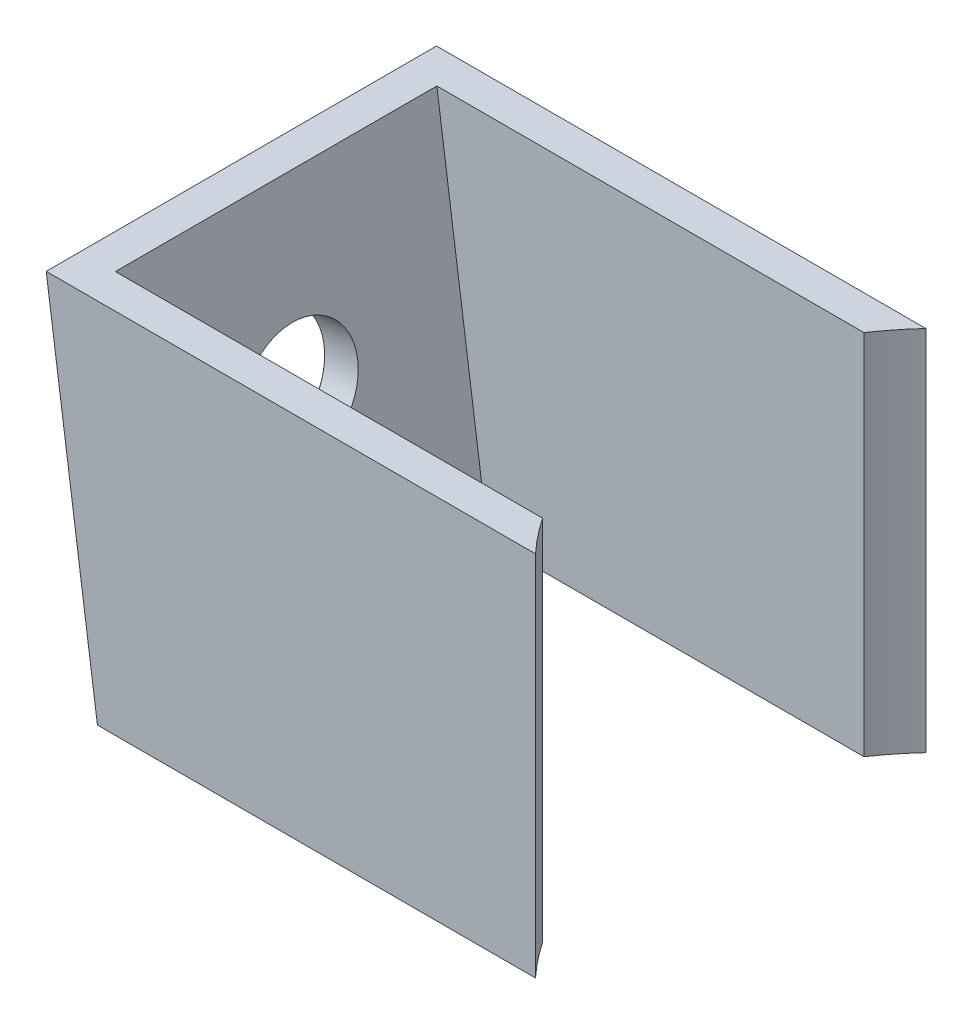
ISO-10303-21;
HEADER;
FILE_DESCRIPTION(('STEP AP214'),'2;1');
FILE_NAME('part.step','',(''),(''),'','','');
FILE_SCHEMA(('AUTOMOTIVE_DESIGN { 1 0 10303 214 1 1 1 1 }'));
ENDSEC;
DATA;
#1=APPLICATION_CONTEXT('core data for automotive mechanical design processes');
#2=APPLICATION_PROTOCOL_DEFINITION('international standard','automotive_design',2000,#1);
#3=PRODUCT_CONTEXT('',#1,'mechanical');
#4=PRODUCT('Part','Part','',(#3));
#5=PRODUCT_RELATED_PRODUCT_CATEGORY('part','',(#4));
#6=PRODUCT_DEFINITION_FORMATION('','',#4);
#7=PRODUCT_DEFINITION_CONTEXT('part definition',#1,'design');
#8=PRODUCT_DEFINITION('design','',#6,#7);
#9=PRODUCT_DEFINITION_SHAPE('','',#8);
#10=(LENGTH_UNIT() NAMED_UNIT(*) SI_UNIT(.MILLI.,.METRE.));
#11=(NAMED_UNIT(*) PLANE_ANGLE_UNIT() SI_UNIT($,.RADIAN.));
#12=(NAMED_UNIT(*) SI_UNIT($,.STERADIAN.) SOLID_ANGLE_UNIT());
#13=UNCERTAINTY_MEASURE_WITH_UNIT(LENGTH_MEASURE(1.E-05),#10,'distance_accuracy_value','');
#14=(GEOMETRIC_REPRESENTATION_CONTEXT(3) GLOBAL_UNCERTAINTY_ASSIGNED_CONTEXT((#13)) GLOBAL_UNIT_ASSIGNED_CONTEXT((#10,
#11,#12)) REPRESENTATION_CONTEXT('',''));
#15=CARTESIAN_POINT('',(0.,0.,0.));
#16=DIRECTION('',(0.,0.,1.));
#17=DIRECTION('',(1.,0.,0.));
#18=AXIS2_PLACEMENT_3D('',#15,#16,#17);
#19=CARTESIAN_POINT('',(-9.60468635614928,8.,17.));
#20=DIRECTION('',(0.,-1.,0.));
#21=DIRECTION('',(1.,0.,0.));
#22=AXIS2_PLACEMENT_3D('',#19,#20,#21);
#23=PLANE('',#22);
#24=DIRECTION('',(-1.,0.,0.));
#25=VECTOR('',#24,1.);
#26=CARTESIAN_POINT('',(-9.60468635614928,8.,17.));
#27=LINE('',#26,#25);
#28=CARTESIAN_POINT('',(-9.60468635614928,8.,17.));
#29=VERTEX_POINT('',#28);
#30=CARTESIAN_POINT('',(-30.9146863561493,7.99999999999999,17.));
#31=VERTEX_POINT('',#30);
#32=EDGE_CURVE('E109',#29,#31,#27,.T.);
#33=ORIENTED_EDGE('',*,*,#32,.F.);
#34=CARTESIAN_POINT('',(-0.439534966237602,8.,8.5));
#35=DIRECTION('',(0.,1.,0.));
#36=DIRECTION('',(-1.,0.,0.));
#37=AXIS2_PLACEMENT_3D('',#34,#35,#36);
#38=CIRCLE('',#37,12.5);
#39=CARTESIAN_POINT('',(-10.7956925548416,8.,15.5));
#40=VERTEX_POINT('',#39);
#41=EDGE_CURVE('E97',#40,#29,#38,.T.);
#42=ORIENTED_EDGE('',*,*,#41,.F.);
#43=DIRECTION('',(-1.,0.,0.));
#44=VECTOR('',#43,1.);
#45=CARTESIAN_POINT('',(0.,8.,15.5));
#46=LINE('',#45,#44);
#47=CARTESIAN_POINT('',(-29.4001873865536,7.99999999999999,15.5));
#48=VERTEX_POINT('',#47);
#49=EDGE_CURVE('E106',#40,#48,#46,.T.);
#50=ORIENTED_EDGE('',*,*,#49,.T.);
#51=DIRECTION('',(0.,0.,-1.));
#52=VECTOR('',#51,1.);
#53=CARTESIAN_POINT('',(-29.4001873865536,7.99999999999999,17.));
#54=LINE('',#53,#52);
#55=CARTESIAN_POINT('',(-29.4001873865536,7.99999999999999,1.5));
#56=VERTEX_POINT('',#55);
#57=EDGE_CURVE('E125',#48,#56,#54,.T.);
#58=ORIENTED_EDGE('',*,*,#57,.T.);
#59=DIRECTION('',(-1.,0.,0.));
#60=VECTOR('',#59,1.);
#61=CARTESIAN_POINT('',(0.,8.,1.5));
#62=LINE('',#61,#60);
#63=CARTESIAN_POINT('',(-10.7956925548416,8.,1.5));
#64=VERTEX_POINT('',#63);
#65=EDGE_CURVE('E152',#64,#56,#62,.T.);
#66=ORIENTED_EDGE('',*,*,#65,.F.);
#67=CARTESIAN_POINT('',(-9.60468635614928,8.,0.));
#68=VERTEX_POINT('',#67);
#69=EDGE_CURVE('E56',#68,#64,#38,.T.);
#70=ORIENTED_EDGE('',*,*,#69,.F.);
#71=DIRECTION('',(-1.,0.,0.));
#72=VECTOR('',#71,1.);
#73=CARTESIAN_POINT('',(-9.60468635614928,8.,0.));
#74=LINE('',#73,#72);
#75=CARTESIAN_POINT('',(-30.9146863561493,7.99999999999999,0.));
#76=VERTEX_POINT('',#75);
#77=EDGE_CURVE('E141',#68,#76,#74,.T.);
#78=ORIENTED_EDGE('',*,*,#77,.T.);
#79=DIRECTION('',(0.,0.,-1.));
#80=VECTOR('',#79,1.);
#81=CARTESIAN_POINT('',(-30.9146863561493,7.99999999999999,17.));
#82=LINE('',#81,#80);
#83=EDGE_CURVE('E41',#31,#76,#82,.T.);
#84=ORIENTED_EDGE('',*,*,#83,.F.);
#85=EDGE_LOOP('',(#33,#42,#50,#58,#66,#70,#78,#84));
#86=FACE_BOUND('',#85,.T.);
#87=ADVANCED_FACE('F34',(#86),#23,.F.);
#88=CARTESIAN_POINT('',(-9.60468635614927,-8.,17.));
#89=DIRECTION('',(0.,1.,0.));
#90=DIRECTION('',(-1.,0.,0.));
#91=AXIS2_PLACEMENT_3D('',#88,#89,#90);
#92=PLANE('',#91);
#93=DIRECTION('',(1.,0.,0.));
#94=VECTOR('',#93,1.);
#95=CARTESIAN_POINT('',(0.,-8.,15.5));
#96=LINE('',#95,#94);
#97=CARTESIAN_POINT('',(-27.1701873865536,-8.,15.5));
#98=VERTEX_POINT('',#97);
#99=CARTESIAN_POINT('',(-10.7956925548416,-8.,15.5));
#100=VERTEX_POINT('',#99);
#101=EDGE_CURVE('E118',#98,#100,#96,.T.);
#102=ORIENTED_EDGE('',*,*,#101,.T.);
#103=CARTESIAN_POINT('',(-0.4395349662376,-8.,8.5));
#104=DIRECTION('',(0.,1.,0.));
#105=DIRECTION('',(-1.,0.,0.));
#106=AXIS2_PLACEMENT_3D('',#103,#104,#105);
#107=CIRCLE('',#106,12.5);
#108=CARTESIAN_POINT('',(-9.60468635614928,-8.,17.));
#109=VERTEX_POINT('',#108);
#110=EDGE_CURVE('E48',#100,#109,#107,.T.);
#111=ORIENTED_EDGE('',*,*,#110,.T.);
#112=DIRECTION('',(1.,0.,0.));
#113=VECTOR('',#112,1.);
#114=CARTESIAN_POINT('',(-9.60468635614927,-8.,17.));
#115=LINE('',#114,#113);
#116=CARTESIAN_POINT('',(-28.6846863561493,-8.,17.));
#117=VERTEX_POINT('',#116);
#118=EDGE_CURVE('E135',#117,#109,#115,.T.);
#119=ORIENTED_EDGE('',*,*,#118,.F.);
#120=DIRECTION('',(0.,0.,-1.));
#121=VECTOR('',#120,1.);
#122=CARTESIAN_POINT('',(-28.6846863561493,-8.,17.));
#123=LINE('',#122,#121);
#124=CARTESIAN_POINT('',(-28.6846863561493,-8.,0.));
#125=VERTEX_POINT('',#124);
#126=EDGE_CURVE('E138',#117,#125,#123,.T.);
#127=ORIENTED_EDGE('',*,*,#126,.T.);
#128=DIRECTION('',(1.,0.,0.));
#129=VECTOR('',#128,1.);
#130=CARTESIAN_POINT('',(-9.60468635614927,-8.,0.));
#131=LINE('',#130,#129);
#132=CARTESIAN_POINT('',(-9.60468635614927,-8.,0.));
#133=VERTEX_POINT('',#132);
#134=EDGE_CURVE('E131',#125,#133,#131,.T.);
#135=ORIENTED_EDGE('',*,*,#134,.T.);
#136=CARTESIAN_POINT('',(-10.7956925548416,-8.,1.5));
#137=VERTEX_POINT('',#136);
#138=EDGE_CURVE('E102',#133,#137,#107,.T.);
#139=ORIENTED_EDGE('',*,*,#138,.T.);
#140=DIRECTION('',(1.,0.,0.));
#141=VECTOR('',#140,1.);
#142=CARTESIAN_POINT('',(0.,-8.,1.5));
#143=LINE('',#142,#141);
#144=CARTESIAN_POINT('',(-27.1701873865536,-8.,1.5));
#145=VERTEX_POINT('',#144);
#146=EDGE_CURVE('E116',#145,#137,#143,.T.);
#147=ORIENTED_EDGE('',*,*,#146,.F.);
#148=DIRECTION('',(0.,0.,-1.));
#149=VECTOR('',#148,1.);
#150=CARTESIAN_POINT('',(-27.1701873865536,-8.,17.));
#151=LINE('',#150,#149);
#152=EDGE_CURVE('E128',#98,#145,#151,.T.);
#153=ORIENTED_EDGE('',*,*,#152,.F.);
#154=EDGE_LOOP('',(#102,#111,#119,#127,#135,#139,#147,#153));
#155=FACE_BOUND('',#154,.T.);
#156=ADVANCED_FACE('F177',(#155),#92,.F.);
#157=CARTESIAN_POINT('',(-30.9146863561493,7.99999999999999,17.));
#158=DIRECTION('',(0.990426556975797,0.138040701378502,0.));
#159=DIRECTION('',(-0.138040701378502,0.990426556975797,0.));
#160=AXIS2_PLACEMENT_3D('',#157,#158,#159);
#161=PLANE('',#160);
#162=CARTESIAN_POINT('',(-29.8346143322471,0.250604312809637,8.5));
#163=DIRECTION('',(-0.990426556975797,-0.138040701378502,0.));
#164=DIRECTION('',(0.138040701378502,-0.990426556975797,0.));
#165=AXIS2_PLACEMENT_3D('',#162,#163,#164);
#166=CIRCLE('',#165,2.525);
#167=CARTESIAN_POINT('',(-29.4860615612664,-2.25022274355425,8.5));
#168=VERTEX_POINT('',#167);
#169=EDGE_CURVE('E157',#168,#168,#166,.T.);
#170=ORIENTED_EDGE('',*,*,#169,.F.);
#171=EDGE_LOOP('',(#170));
#172=FACE_BOUND('',#171,.T.);
#173=DIRECTION('',(0.138040701378502,-0.990426556975797,0.));
#174=VECTOR('',#173,1.);
#175=CARTESIAN_POINT('',(-30.9146863561493,7.99999999999999,0.));
#176=LINE('',#175,#174);
#177=EDGE_CURVE('E143',#76,#125,#176,.T.);
#178=ORIENTED_EDGE('',*,*,#177,.T.);
#179=ORIENTED_EDGE('',*,*,#126,.F.);
#180=DIRECTION('',(0.138040701378502,-0.990426556975797,0.));
#181=VECTOR('',#180,1.);
#182=CARTESIAN_POINT('',(-30.9146863561493,7.99999999999999,17.));
#183=LINE('',#182,#181);
#184=EDGE_CURVE('E133',#31,#117,#183,.T.);
#185=ORIENTED_EDGE('',*,*,#184,.F.);
#186=ORIENTED_EDGE('',*,*,#83,.T.);
#187=EDGE_LOOP('',(#178,#179,#185,#186));
#188=FACE_BOUND('',#187,.T.);
#189=ADVANCED_FACE('F187',(#172,#188),#161,.F.);
#190=CARTESIAN_POINT('',(0.,0.,17.));
#191=DIRECTION('',(0.,0.,-1.));
#192=DIRECTION('',(-1.,0.,0.));
#193=AXIS2_PLACEMENT_3D('',#190,#191,#192);
#194=PLANE('',#193);
#195=DIRECTION('',(0.,1.,0.));
#196=VECTOR('',#195,1.);
#197=CARTESIAN_POINT('',(-9.60468635614928,8.,17.));
#198=LINE('',#197,#196);
#199=EDGE_CURVE('E129',#109,#29,#198,.T.);
#200=ORIENTED_EDGE('',*,*,#199,.T.);
#201=ORIENTED_EDGE('',*,*,#32,.T.);
#202=ORIENTED_EDGE('',*,*,#184,.T.);
#203=ORIENTED_EDGE('',*,*,#118,.T.);
#204=EDGE_LOOP('',(#200,#201,#202,#203));
#205=FACE_BOUND('',#204,.T.);
#206=ADVANCED_FACE('F183',(#205),#194,.F.);
#207=CARTESIAN_POINT('',(0.,0.,0.));
#208=DIRECTION('',(0.,0.,-1.));
#209=DIRECTION('',(-1.,0.,0.));
#210=AXIS2_PLACEMENT_3D('',#207,#208,#209);
#211=PLANE('',#210);
#212=DIRECTION('',(0.,1.,0.));
#213=VECTOR('',#212,1.);
#214=CARTESIAN_POINT('',(-9.60468635614928,8.,0.));
#215=LINE('',#214,#213);
#216=EDGE_CURVE('E139',#133,#68,#215,.T.);
#217=ORIENTED_EDGE('',*,*,#216,.F.);
#218=ORIENTED_EDGE('',*,*,#134,.F.);
#219=ORIENTED_EDGE('',*,*,#177,.F.);
#220=ORIENTED_EDGE('',*,*,#77,.F.);
#221=EDGE_LOOP('',(#217,#218,#219,#220));
#222=FACE_BOUND('',#221,.T.);
#223=ADVANCED_FACE('F190',(#222),#211,.T.);
#224=CARTESIAN_POINT('',(-29.4290465206856,8.20706105206775,17.));
#225=DIRECTION('',(0.990426556975797,0.138040701378502,0.));
#226=DIRECTION('',(-0.138040701378502,0.990426556975797,0.));
#227=AXIS2_PLACEMENT_3D('',#224,#225,#226);
#228=PLANE('',#227);
#229=CARTESIAN_POINT('',(-28.3489744967834,0.45766536487739,8.5));
#230=DIRECTION('',(0.990426556975797,0.138040701378502,0.));
#231=DIRECTION('',(-0.138040701378502,0.990426556975797,0.));
#232=AXIS2_PLACEMENT_3D('',#229,#230,#231);
#233=CIRCLE('',#232,2.5);
#234=CARTESIAN_POINT('',(-28.6940762502297,2.93373175731688,8.5));
#235=VERTEX_POINT('',#234);
#236=EDGE_CURVE('E150',#235,#235,#233,.T.);
#237=ORIENTED_EDGE('',*,*,#236,.F.);
#238=EDGE_LOOP('',(#237));
#239=FACE_BOUND('',#238,.T.);
#240=DIRECTION('',(0.138040701378502,-0.990426556975797,0.));
#241=VECTOR('',#240,1.);
#242=CARTESIAN_POINT('',(-27.7462064871783,-3.86712752915048,1.5));
#243=LINE('',#242,#241);
#244=EDGE_CURVE('E121',#56,#145,#243,.T.);
#245=ORIENTED_EDGE('',*,*,#244,.F.);
#246=ORIENTED_EDGE('',*,*,#57,.F.);
#247=DIRECTION('',(0.138040701378502,-0.990426556975797,0.));
#248=VECTOR('',#247,1.);
#249=CARTESIAN_POINT('',(-27.7462064871783,-3.86712752915048,15.5));
#250=LINE('',#249,#248);
#251=EDGE_CURVE('E115',#48,#98,#250,.T.);
#252=ORIENTED_EDGE('',*,*,#251,.T.);
#253=ORIENTED_EDGE('',*,*,#152,.T.);
#254=EDGE_LOOP('',(#245,#246,#252,#253));
#255=FACE_BOUND('',#254,.T.);
#256=ADVANCED_FACE('F171',(#239,#255),#228,.T.);
#257=CARTESIAN_POINT('',(0.,0.,15.5));
#258=DIRECTION('',(0.,0.,-1.));
#259=DIRECTION('',(-1.,0.,0.));
#260=AXIS2_PLACEMENT_3D('',#257,#258,#259);
#261=PLANE('',#260);
#262=DIRECTION('',(0.,1.,0.));
#263=VECTOR('',#262,1.);
#264=CARTESIAN_POINT('',(-10.7956925548416,-9.,15.5));
#265=LINE('',#264,#263);
#266=EDGE_CURVE('E94',#100,#40,#265,.T.);
#267=ORIENTED_EDGE('',*,*,#266,.F.);
#268=ORIENTED_EDGE('',*,*,#101,.F.);
#269=ORIENTED_EDGE('',*,*,#251,.F.);
#270=ORIENTED_EDGE('',*,*,#49,.F.);
#271=EDGE_LOOP('',(#267,#268,#269,#270));
#272=FACE_BOUND('',#271,.T.);
#273=ADVANCED_FACE('F113',(#272),#261,.T.);
#274=CARTESIAN_POINT('',(0.,0.,1.5));
#275=DIRECTION('',(0.,0.,-1.));
#276=DIRECTION('',(-1.,0.,0.));
#277=AXIS2_PLACEMENT_3D('',#274,#275,#276);
#278=PLANE('',#277);
#279=ORIENTED_EDGE('',*,*,#146,.T.);
#280=DIRECTION('',(0.,1.,0.));
#281=VECTOR('',#280,1.);
#282=CARTESIAN_POINT('',(-10.7956925548416,-9.,1.5));
#283=LINE('',#282,#281);
#284=EDGE_CURVE('E11',#137,#64,#283,.T.);
#285=ORIENTED_EDGE('',*,*,#284,.T.);
#286=ORIENTED_EDGE('',*,*,#65,.T.);
#287=ORIENTED_EDGE('',*,*,#244,.T.);
#288=EDGE_LOOP('',(#279,#285,#286,#287));
#289=FACE_BOUND('',#288,.T.);
#290=ADVANCED_FACE('F173',(#289),#278,.F.);
#291=CARTESIAN_POINT('',(-29.8346143322471,0.250604312809637,8.5));
#292=DIRECTION('',(-0.990426556975797,-0.138040701378502,0.));
#293=DIRECTION('',(0.138040701378502,-0.990426556975797,0.));
#294=AXIS2_PLACEMENT_3D('',#291,#292,#293);
#295=CYLINDRICAL_SURFACE('',#294,2.5);
#296=ORIENTED_EDGE('',*,*,#236,.T.);
#297=EDGE_LOOP('',(#296));
#298=FACE_BOUND('',#297,.T.);
#299=CARTESIAN_POINT('',(-29.8098536683227,0.2540553303441,8.5));
#300=DIRECTION('',(-0.990426556975797,-0.138040701378502,0.));
#301=DIRECTION('',(0.138040701378502,-0.990426556975797,0.));
#302=AXIS2_PLACEMENT_3D('',#299,#300,#301);
#303=CIRCLE('',#302,2.5);
#304=CARTESIAN_POINT('',(-29.4647519148765,-2.22201106209539,8.5));
#305=VERTEX_POINT('',#304);
#306=EDGE_CURVE('E153',#305,#305,#303,.T.);
#307=ORIENTED_EDGE('',*,*,#306,.T.);
#308=EDGE_LOOP('',(#307));
#309=FACE_BOUND('',#308,.T.);
#310=ADVANCED_FACE('F216',(#298,#309),#295,.F.);
#311=CARTESIAN_POINT('',(-29.8346143322471,0.250604312809637,8.5));
#312=DIRECTION('',(-0.990426556975797,-0.138040701378502,0.));
#313=DIRECTION('',(0.138040701378502,-0.990426556975797,0.));
#314=AXIS2_PLACEMENT_3D('',#311,#312,#313);
#315=CONICAL_SURFACE('',#314,2.525,0.785398163397391);
#316=ORIENTED_EDGE('',*,*,#306,.F.);
#317=EDGE_LOOP('',(#316));
#318=FACE_BOUND('',#317,.T.);
#319=ORIENTED_EDGE('',*,*,#169,.T.);
#320=EDGE_LOOP('',(#319));
#321=FACE_BOUND('',#320,.T.);
#322=ADVANCED_FACE('F214',(#318,#321),#315,.F.);
#323=CARTESIAN_POINT('',(-0.4395349662376,-9.,8.5));
#324=DIRECTION('',(0.,1.,0.));
#325=DIRECTION('',(-1.,0.,0.));
#326=AXIS2_PLACEMENT_3D('',#323,#324,#325);
#327=CYLINDRICAL_SURFACE('',#326,12.5);
#328=ORIENTED_EDGE('',*,*,#69,.T.);
#329=ORIENTED_EDGE('',*,*,#284,.F.);
#330=ORIENTED_EDGE('',*,*,#138,.F.);
#331=ORIENTED_EDGE('',*,*,#216,.T.);
#332=EDGE_LOOP('',(#328,#329,#330,#331));
#333=FACE_BOUND('',#332,.T.);
#334=ADVANCED_FACE('F175',(#333),#327,.F.);
#335=ORIENTED_EDGE('',*,*,#110,.F.);
#336=ORIENTED_EDGE('',*,*,#266,.T.);
#337=ORIENTED_EDGE('',*,*,#41,.T.);
#338=ORIENTED_EDGE('',*,*,#199,.F.);
#339=EDGE_LOOP('',(#335,#336,#337,#338));
#340=FACE_BOUND('',#339,.T.);
#341=ADVANCED_FACE('F96',(#340),#327,.F.);
#342=CLOSED_SHELL('',(#87,#156,#189,#206,#223,#256,#273,#290,#310,#322,#334,#341));
#343=MANIFOLD_SOLID_BREP('B2',#342);
#344=ADVANCED_BREP_SHAPE_REPRESENTATION('',(#18,#343),#14);
#345=SHAPE_DEFINITION_REPRESENTATION(#9,#344);
ENDSEC;
END-ISO-10303-21;
